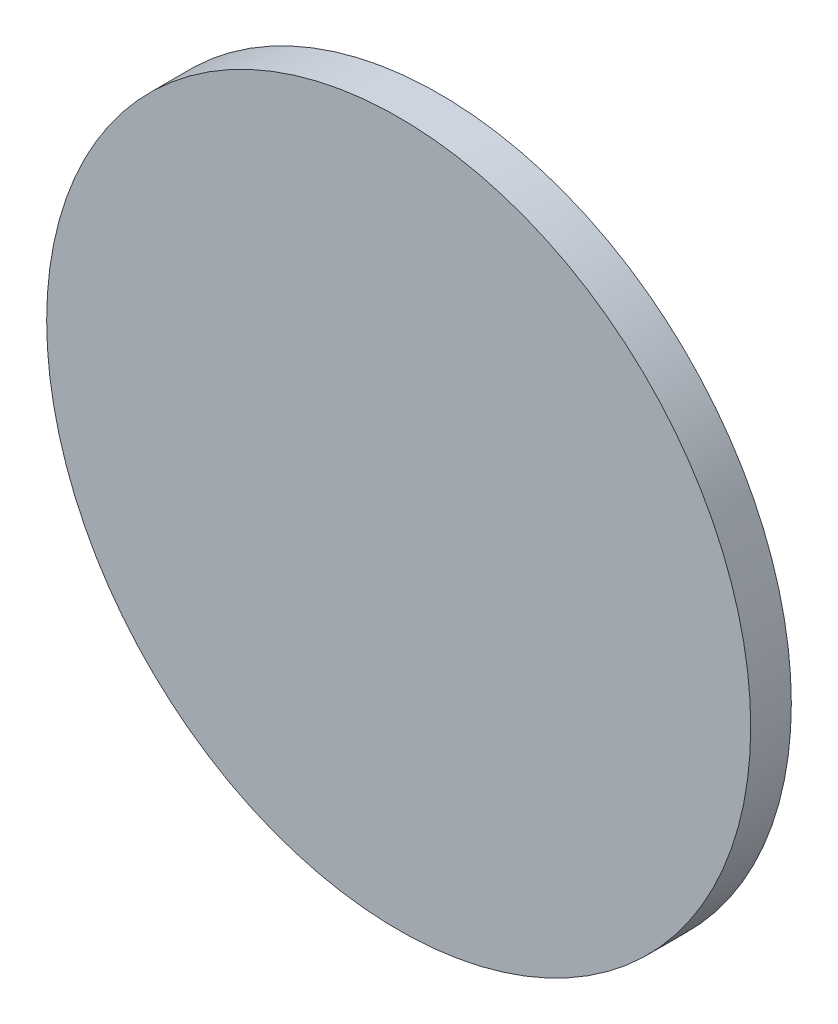
ISO-10303-21;
HEADER;
FILE_DESCRIPTION(('STEP AP214'),'2;1');
FILE_NAME('part.step','',(''),(''),'','','');
FILE_SCHEMA(('AUTOMOTIVE_DESIGN { 1 0 10303 214 1 1 1 1 }'));
ENDSEC;
DATA;
#1=APPLICATION_CONTEXT('core data for automotive mechanical design processes');
#2=APPLICATION_PROTOCOL_DEFINITION('international standard','automotive_design',2000,#1);
#3=PRODUCT_CONTEXT('',#1,'mechanical');
#4=PRODUCT('Part','Part','',(#3));
#5=PRODUCT_RELATED_PRODUCT_CATEGORY('part','',(#4));
#6=PRODUCT_DEFINITION_FORMATION('','',#4);
#7=PRODUCT_DEFINITION_CONTEXT('part definition',#1,'design');
#8=PRODUCT_DEFINITION('design','',#6,#7);
#9=PRODUCT_DEFINITION_SHAPE('','',#8);
#10=(LENGTH_UNIT() NAMED_UNIT(*) SI_UNIT(.MILLI.,.METRE.));
#11=(NAMED_UNIT(*) PLANE_ANGLE_UNIT() SI_UNIT($,.RADIAN.));
#12=(NAMED_UNIT(*) SI_UNIT($,.STERADIAN.) SOLID_ANGLE_UNIT());
#13=UNCERTAINTY_MEASURE_WITH_UNIT(LENGTH_MEASURE(1.E-05),#10,'distance_accuracy_value','');
#14=(GEOMETRIC_REPRESENTATION_CONTEXT(3) GLOBAL_UNCERTAINTY_ASSIGNED_CONTEXT((#13)) GLOBAL_UNIT_ASSIGNED_CONTEXT((#10,
#11,#12)) REPRESENTATION_CONTEXT('',''));
#15=CARTESIAN_POINT('',(0.,0.,0.));
#16=DIRECTION('',(0.,0.,1.));
#17=DIRECTION('',(1.,0.,0.));
#18=AXIS2_PLACEMENT_3D('',#15,#16,#17);
#19=CARTESIAN_POINT('',(0.,0.,38.1));
#20=DIRECTION('',(0.,0.,-1.));
#21=DIRECTION('',(-1.,0.,0.));
#22=AXIS2_PLACEMENT_3D('',#19,#20,#21);
#23=CYLINDRICAL_SURFACE('',#22,330.2);
#24=CARTESIAN_POINT('',(0.,0.,38.1));
#25=DIRECTION('',(0.,0.,1.));
#26=DIRECTION('',(1.,0.,0.));
#27=AXIS2_PLACEMENT_3D('',#24,#25,#26);
#28=CIRCLE('',#27,330.2);
#29=CARTESIAN_POINT('',(330.2,0.,38.1));
#30=VERTEX_POINT('',#29);
#31=EDGE_CURVE('E10',#30,#30,#28,.T.);
#32=ORIENTED_EDGE('',*,*,#31,.F.);
#33=EDGE_LOOP('',(#32));
#34=FACE_BOUND('',#33,.T.);
#35=CARTESIAN_POINT('',(0.,0.,0.));
#36=DIRECTION('',(0.,0.,1.));
#37=DIRECTION('',(1.,0.,0.));
#38=AXIS2_PLACEMENT_3D('',#35,#36,#37);
#39=CIRCLE('',#38,330.2);
#40=CARTESIAN_POINT('',(330.2,0.,0.));
#41=VERTEX_POINT('',#40);
#42=EDGE_CURVE('E40',#41,#41,#39,.T.);
#43=ORIENTED_EDGE('',*,*,#42,.T.);
#44=EDGE_LOOP('',(#43));
#45=FACE_BOUND('',#44,.T.);
#46=ADVANCED_FACE('F37',(#34,#45),#23,.T.);
#47=CARTESIAN_POINT('',(0.,0.,38.1));
#48=DIRECTION('',(0.,0.,1.));
#49=DIRECTION('',(1.,0.,0.));
#50=AXIS2_PLACEMENT_3D('',#47,#48,#49);
#51=PLANE('',#50);
#52=ORIENTED_EDGE('',*,*,#31,.T.);
#53=EDGE_LOOP('',(#52));
#54=FACE_BOUND('',#53,.T.);
#55=ADVANCED_FACE('F54',(#54),#51,.T.);
#56=CARTESIAN_POINT('',(0.,0.,0.));
#57=DIRECTION('',(0.,0.,1.));
#58=DIRECTION('',(1.,0.,0.));
#59=AXIS2_PLACEMENT_3D('',#56,#57,#58);
#60=PLANE('',#59);
#61=ORIENTED_EDGE('',*,*,#42,.F.);
#62=EDGE_LOOP('',(#61));
#63=FACE_BOUND('',#62,.T.);
#64=ADVANCED_FACE('F52',(#63),#60,.F.);
#65=CLOSED_SHELL('',(#46,#55,#64));
#66=MANIFOLD_SOLID_BREP('B2',#65);
#67=ADVANCED_BREP_SHAPE_REPRESENTATION('',(#18,#66),#14);
#68=SHAPE_DEFINITION_REPRESENTATION(#9,#67);
ENDSEC;
END-ISO-10303-21;
